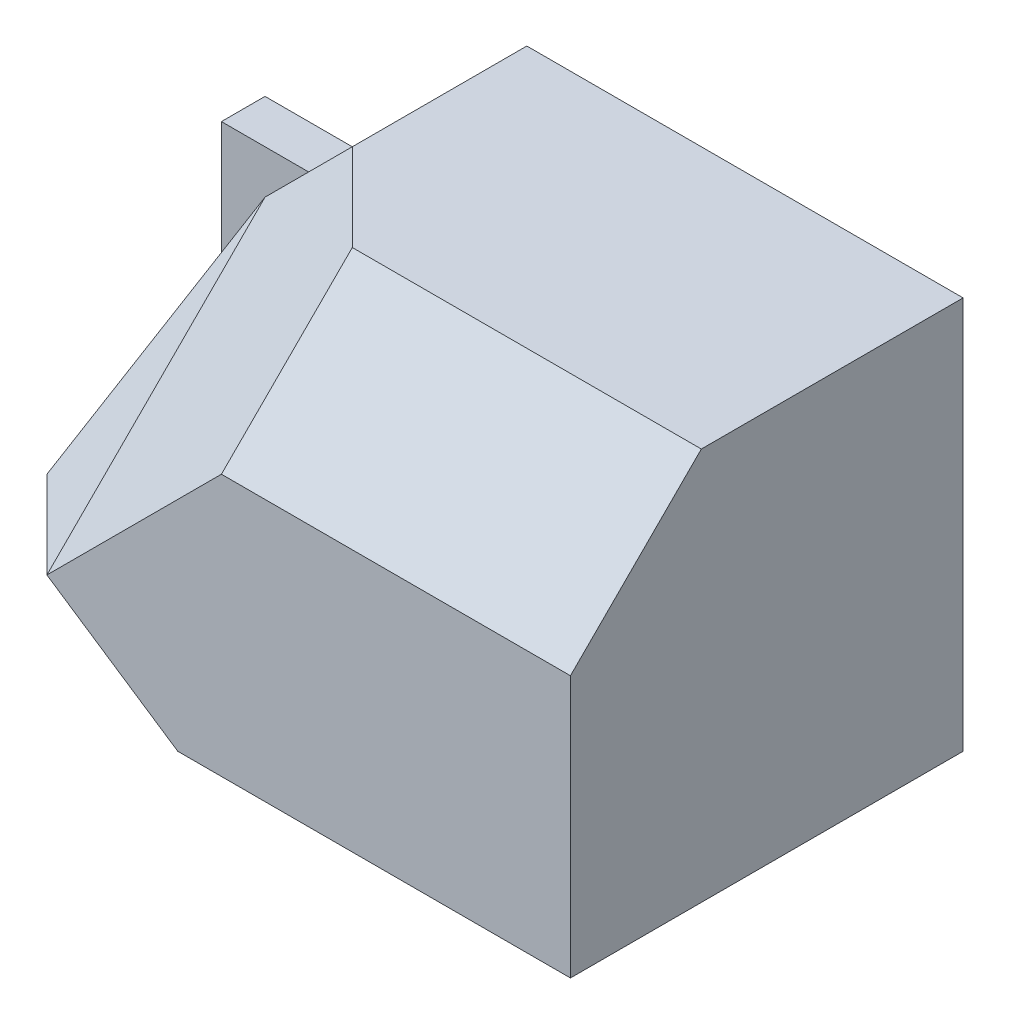
ISO-10303-21;
HEADER;
FILE_DESCRIPTION(('STEP AP214'),'2;1');
FILE_NAME('part.step','',(''),(''),'','','');
FILE_SCHEMA(('AUTOMOTIVE_DESIGN { 1 0 10303 214 1 1 1 1 }'));
ENDSEC;
DATA;
#1=APPLICATION_CONTEXT('core data for automotive mechanical design processes');
#2=APPLICATION_PROTOCOL_DEFINITION('international standard','automotive_design',2000,#1);
#3=PRODUCT_CONTEXT('',#1,'mechanical');
#4=PRODUCT('Part','Part','',(#3));
#5=PRODUCT_RELATED_PRODUCT_CATEGORY('part','',(#4));
#6=PRODUCT_DEFINITION_FORMATION('','',#4);
#7=PRODUCT_DEFINITION_CONTEXT('part definition',#1,'design');
#8=PRODUCT_DEFINITION('design','',#6,#7);
#9=PRODUCT_DEFINITION_SHAPE('','',#8);
#10=(LENGTH_UNIT() NAMED_UNIT(*) SI_UNIT(.MILLI.,.METRE.));
#11=(NAMED_UNIT(*) PLANE_ANGLE_UNIT() SI_UNIT($,.RADIAN.));
#12=(NAMED_UNIT(*) SI_UNIT($,.STERADIAN.) SOLID_ANGLE_UNIT());
#13=UNCERTAINTY_MEASURE_WITH_UNIT(LENGTH_MEASURE(1.E-05),#10,'distance_accuracy_value','');
#14=(GEOMETRIC_REPRESENTATION_CONTEXT(3) GLOBAL_UNCERTAINTY_ASSIGNED_CONTEXT((#13)) GLOBAL_UNIT_ASSIGNED_CONTEXT((#10,
#11,#12)) REPRESENTATION_CONTEXT('',''));
#15=CARTESIAN_POINT('',(0.,0.,0.));
#16=DIRECTION('',(0.,0.,1.));
#17=DIRECTION('',(1.,0.,0.));
#18=AXIS2_PLACEMENT_3D('',#15,#16,#17);
#19=CARTESIAN_POINT('',(-3.25,3.25,9.));
#20=DIRECTION('',(-0.707106781186547,0.707106781186547,0.));
#21=DIRECTION('',(-0.707106781186548,-0.707106781186548,0.));
#22=AXIS2_PLACEMENT_3D('',#19,#20,#21);
#23=PLANE('',#22);
#24=DIRECTION('',(0.,0.,1.));
#25=VECTOR('',#24,1.);
#26=CARTESIAN_POINT('',(-4.,2.5,2.));
#27=LINE('',#26,#25);
#28=CARTESIAN_POINT('',(-4.,2.5,2.));
#29=VERTEX_POINT('',#28);
#30=CARTESIAN_POINT('',(-4.,2.5,4.));
#31=VERTEX_POINT('',#30);
#32=EDGE_CURVE('E168',#29,#31,#27,.T.);
#33=ORIENTED_EDGE('',*,*,#32,.T.);
#34=DIRECTION('',(0.707106781186548,0.707106781186547,0.));
#35=VECTOR('',#34,1.);
#36=CARTESIAN_POINT('',(-4.,2.5,4.));
#37=LINE('',#36,#35);
#38=CARTESIAN_POINT('',(-2.,4.5,4.));
#39=VERTEX_POINT('',#38);
#40=EDGE_CURVE('E51',#31,#39,#37,.T.);
#41=ORIENTED_EDGE('',*,*,#40,.T.);
#42=DIRECTION('',(0.,0.,-1.));
#43=VECTOR('',#42,1.);
#44=CARTESIAN_POINT('',(-2.,4.5,9.));
#45=LINE('',#44,#43);
#46=CARTESIAN_POINT('',(-2.,4.5,0.));
#47=VERTEX_POINT('',#46);
#48=EDGE_CURVE('E187',#39,#47,#45,.T.);
#49=ORIENTED_EDGE('',*,*,#48,.T.);
#50=DIRECTION('',(0.707106781186548,0.707106781186548,0.));
#51=VECTOR('',#50,1.);
#52=CARTESIAN_POINT('',(-3.25,3.25,0.));
#53=LINE('',#52,#51);
#54=CARTESIAN_POINT('',(-6.,0.5,0.));
#55=VERTEX_POINT('',#54);
#56=EDGE_CURVE('E180',#55,#47,#53,.T.);
#57=ORIENTED_EDGE('',*,*,#56,.F.);
#58=DIRECTION('',(0.,0.,-1.));
#59=VECTOR('',#58,1.);
#60=CARTESIAN_POINT('',(-6.,0.5,9.));
#61=LINE('',#60,#59);
#62=CARTESIAN_POINT('',(-6.,0.5,0.999999999999999));
#63=VERTEX_POINT('',#62);
#64=EDGE_CURVE('E43',#63,#55,#61,.T.);
#65=ORIENTED_EDGE('',*,*,#64,.F.);
#66=CARTESIAN_POINT('',(-6.,0.5,2.));
#67=VERTEX_POINT('',#66);
#68=EDGE_CURVE('E12',#67,#63,#61,.T.);
#69=ORIENTED_EDGE('',*,*,#68,.F.);
#70=DIRECTION('',(-0.707106781186547,-0.707106781186548,0.));
#71=VECTOR('',#70,1.);
#72=CARTESIAN_POINT('',(-6.,0.5,2.));
#73=LINE('',#72,#71);
#74=EDGE_CURVE('E59',#29,#67,#73,.T.);
#75=ORIENTED_EDGE('',*,*,#74,.F.);
#76=EDGE_LOOP('',(#33,#41,#49,#57,#65,#69,#75));
#77=FACE_BOUND('',#76,.T.);
#78=ADVANCED_FACE('F35',(#77),#23,.T.);
#79=CARTESIAN_POINT('',(0.,4.5,9.));
#80=DIRECTION('',(0.,1.,0.));
#81=DIRECTION('',(0.,0.,1.));
#82=AXIS2_PLACEMENT_3D('',#79,#80,#81);
#83=PLANE('',#82);
#84=DIRECTION('',(-1.,0.,0.));
#85=VECTOR('',#84,1.);
#86=CARTESIAN_POINT('',(8.,4.5,6.));
#87=LINE('',#86,#85);
#88=CARTESIAN_POINT('',(8.,4.5,6.));
#89=VERTEX_POINT('',#88);
#90=CARTESIAN_POINT('',(0.,4.5,6.));
#91=VERTEX_POINT('',#90);
#92=EDGE_CURVE('E212',#89,#91,#87,.T.);
#93=ORIENTED_EDGE('',*,*,#92,.F.);
#94=DIRECTION('',(0.,0.,-1.));
#95=VECTOR('',#94,1.);
#96=CARTESIAN_POINT('',(8.,4.5,9.));
#97=LINE('',#96,#95);
#98=CARTESIAN_POINT('',(8.,4.5,0.));
#99=VERTEX_POINT('',#98);
#100=EDGE_CURVE('E205',#89,#99,#97,.T.);
#101=ORIENTED_EDGE('',*,*,#100,.T.);
#102=DIRECTION('',(1.,0.,0.));
#103=VECTOR('',#102,1.);
#104=CARTESIAN_POINT('',(0.,4.5,0.));
#105=LINE('',#104,#103);
#106=EDGE_CURVE('E184',#47,#99,#105,.T.);
#107=ORIENTED_EDGE('',*,*,#106,.F.);
#108=ORIENTED_EDGE('',*,*,#48,.F.);
#109=DIRECTION('',(0.707106781186547,0.,0.707106781186548));
#110=VECTOR('',#109,1.);
#111=CARTESIAN_POINT('',(-2.,4.5,4.));
#112=LINE('',#111,#110);
#113=EDGE_CURVE('E285',#39,#91,#112,.T.);
#114=ORIENTED_EDGE('',*,*,#113,.T.);
#115=EDGE_LOOP('',(#93,#101,#107,#108,#114));
#116=FACE_BOUND('',#115,.T.);
#117=ADVANCED_FACE('F277',(#116),#83,.T.);
#118=CARTESIAN_POINT('',(0.,0.,9.));
#119=DIRECTION('',(0.,0.,1.));
#120=DIRECTION('',(1.,0.,0.));
#121=AXIS2_PLACEMENT_3D('',#118,#119,#120);
#122=PLANE('',#121);
#123=DIRECTION('',(-0.832050294337844,0.554700196225229,0.));
#124=VECTOR('',#123,1.);
#125=CARTESIAN_POINT('',(-4.,-2.5,9.));
#126=LINE('',#125,#124);
#127=CARTESIAN_POINT('',(-1.,-4.5,9.));
#128=VERTEX_POINT('',#127);
#129=CARTESIAN_POINT('',(-4.,-2.5,9.));
#130=VERTEX_POINT('',#129);
#131=EDGE_CURVE('E143',#128,#130,#126,.T.);
#132=ORIENTED_EDGE('',*,*,#131,.F.);
#133=DIRECTION('',(1.,0.,0.));
#134=VECTOR('',#133,1.);
#135=CARTESIAN_POINT('',(0.,-4.5,9.));
#136=LINE('',#135,#134);
#137=CARTESIAN_POINT('',(8.,-4.5,9.));
#138=VERTEX_POINT('',#137);
#139=EDGE_CURVE('E181',#128,#138,#136,.T.);
#140=ORIENTED_EDGE('',*,*,#139,.T.);
#141=DIRECTION('',(0.,1.,0.));
#142=VECTOR('',#141,1.);
#143=CARTESIAN_POINT('',(8.,0.,9.));
#144=LINE('',#143,#142);
#145=CARTESIAN_POINT('',(8.,1.5,9.));
#146=VERTEX_POINT('',#145);
#147=EDGE_CURVE('E183',#138,#146,#144,.T.);
#148=ORIENTED_EDGE('',*,*,#147,.T.);
#149=DIRECTION('',(-1.,0.,0.));
#150=VECTOR('',#149,1.);
#151=CARTESIAN_POINT('',(8.,1.5,9.));
#152=LINE('',#151,#150);
#153=CARTESIAN_POINT('',(0.,1.5,9.));
#154=VERTEX_POINT('',#153);
#155=EDGE_CURVE('E214',#146,#154,#152,.T.);
#156=ORIENTED_EDGE('',*,*,#155,.T.);
#157=DIRECTION('',(-0.707106781186548,-0.707106781186548,0.));
#158=VECTOR('',#157,1.);
#159=CARTESIAN_POINT('',(-4.,-2.5,9.));
#160=LINE('',#159,#158);
#161=EDGE_CURVE('E236',#154,#130,#160,.T.);
#162=ORIENTED_EDGE('',*,*,#161,.T.);
#163=EDGE_LOOP('',(#132,#140,#148,#156,#162));
#164=FACE_BOUND('',#163,.T.);
#165=ADVANCED_FACE('F239',(#164),#122,.T.);
#166=CARTESIAN_POINT('',(-4.,2.5,2.));
#167=DIRECTION('',(1.,0.,0.));
#168=DIRECTION('',(0.,1.,0.));
#169=AXIS2_PLACEMENT_3D('',#166,#167,#168);
#170=PLANE('',#169);
#171=DIRECTION('',(0.,0.707106781186548,-0.707106781186548));
#172=VECTOR('',#171,1.);
#173=CARTESIAN_POINT('',(-4.,-2.5,9.));
#174=LINE('',#173,#172);
#175=EDGE_CURVE('E220',#130,#31,#174,.T.);
#176=ORIENTED_EDGE('',*,*,#175,.T.);
#177=ORIENTED_EDGE('',*,*,#32,.F.);
#178=DIRECTION('',(0.,0.707106781186547,-0.707106781186548));
#179=VECTOR('',#178,1.);
#180=CARTESIAN_POINT('',(-4.,2.5,2.));
#181=LINE('',#180,#179);
#182=CARTESIAN_POINT('',(-4.,-2.5,7.));
#183=VERTEX_POINT('',#182);
#184=EDGE_CURVE('E134',#183,#29,#181,.T.);
#185=ORIENTED_EDGE('',*,*,#184,.F.);
#186=DIRECTION('',(0.,0.,1.));
#187=VECTOR('',#186,1.);
#188=CARTESIAN_POINT('',(-4.,-2.5,7.));
#189=LINE('',#188,#187);
#190=EDGE_CURVE('E160',#183,#130,#189,.T.);
#191=ORIENTED_EDGE('',*,*,#190,.T.);
#192=EDGE_LOOP('',(#176,#177,#185,#191));
#193=FACE_BOUND('',#192,.T.);
#194=ADVANCED_FACE('F242',(#193),#170,.F.);
#195=CARTESIAN_POINT('',(0.,-4.5,9.));
#196=DIRECTION('',(0.,1.,0.));
#197=DIRECTION('',(0.,0.,1.));
#198=AXIS2_PLACEMENT_3D('',#195,#196,#197);
#199=PLANE('',#198);
#200=ORIENTED_EDGE('',*,*,#139,.F.);
#201=DIRECTION('',(0.,0.,1.));
#202=VECTOR('',#201,1.);
#203=CARTESIAN_POINT('',(-1.,-4.5,7.));
#204=LINE('',#203,#202);
#205=CARTESIAN_POINT('',(-1.,-4.5,7.));
#206=VERTEX_POINT('',#205);
#207=EDGE_CURVE('E142',#206,#128,#204,.T.);
#208=ORIENTED_EDGE('',*,*,#207,.F.);
#209=DIRECTION('',(1.,0.,0.));
#210=VECTOR('',#209,1.);
#211=CARTESIAN_POINT('',(-1.,-4.5,7.));
#212=LINE('',#211,#210);
#213=CARTESIAN_POINT('',(-6.,-4.5,7.));
#214=VERTEX_POINT('',#213);
#215=EDGE_CURVE('E128',#214,#206,#212,.T.);
#216=ORIENTED_EDGE('',*,*,#215,.F.);
#217=DIRECTION('',(0.707106781186548,0.,0.707106781186548));
#218=VECTOR('',#217,1.);
#219=CARTESIAN_POINT('',(-8.,-4.5,5.));
#220=LINE('',#219,#218);
#221=CARTESIAN_POINT('',(-8.,-4.5,5.));
#222=VERTEX_POINT('',#221);
#223=EDGE_CURVE('E133',#222,#214,#220,.T.);
#224=ORIENTED_EDGE('',*,*,#223,.F.);
#225=DIRECTION('',(0.,0.,-1.));
#226=VECTOR('',#225,1.);
#227=CARTESIAN_POINT('',(-8.,-4.5,9.));
#228=LINE('',#227,#226);
#229=CARTESIAN_POINT('',(-8.,-4.5,0.999999999999999));
#230=VERTEX_POINT('',#229);
#231=EDGE_CURVE('E210',#222,#230,#228,.T.);
#232=ORIENTED_EDGE('',*,*,#231,.T.);
#233=CARTESIAN_POINT('',(-8.,-4.5,0.));
#234=VERTEX_POINT('',#233);
#235=EDGE_CURVE('E264',#230,#234,#228,.T.);
#236=ORIENTED_EDGE('',*,*,#235,.T.);
#237=DIRECTION('',(1.,0.,0.));
#238=VECTOR('',#237,1.);
#239=CARTESIAN_POINT('',(0.,-4.5,0.));
#240=LINE('',#239,#238);
#241=CARTESIAN_POINT('',(8.,-4.5,0.));
#242=VERTEX_POINT('',#241);
#243=EDGE_CURVE('E196',#234,#242,#240,.T.);
#244=ORIENTED_EDGE('',*,*,#243,.T.);
#245=DIRECTION('',(0.,0.,-1.));
#246=VECTOR('',#245,1.);
#247=CARTESIAN_POINT('',(8.,-4.5,9.));
#248=LINE('',#247,#246);
#249=EDGE_CURVE('E267',#138,#242,#248,.T.);
#250=ORIENTED_EDGE('',*,*,#249,.F.);
#251=EDGE_LOOP('',(#200,#208,#216,#224,#232,#236,#244,#250));
#252=FACE_BOUND('',#251,.T.);
#253=ADVANCED_FACE('F140',(#252),#199,.F.);
#254=CARTESIAN_POINT('',(-6.,0.5,0.999999999999999));
#255=DIRECTION('',(0.928476690885259,-0.371390676354104,0.));
#256=DIRECTION('',(0.371390676354104,0.928476690885259,0.));
#257=AXIS2_PLACEMENT_3D('',#254,#255,#256);
#258=PLANE('',#257);
#259=DIRECTION('',(-0.324442842261525,-0.811107105653813,0.486664263392288));
#260=VECTOR('',#259,1.);
#261=CARTESIAN_POINT('',(-8.,-4.5,5.));
#262=LINE('',#261,#260);
#263=EDGE_CURVE('E146',#67,#222,#262,.T.);
#264=ORIENTED_EDGE('',*,*,#263,.F.);
#265=ORIENTED_EDGE('',*,*,#68,.T.);
#266=DIRECTION('',(0.371390676354104,0.928476690885259,0.));
#267=VECTOR('',#266,1.);
#268=CARTESIAN_POINT('',(-6.,0.5,0.999999999999999));
#269=LINE('',#268,#267);
#270=EDGE_CURVE('E150',#230,#63,#269,.T.);
#271=ORIENTED_EDGE('',*,*,#270,.F.);
#272=ORIENTED_EDGE('',*,*,#231,.F.);
#273=EDGE_LOOP('',(#264,#265,#271,#272));
#274=FACE_BOUND('',#273,.T.);
#275=ADVANCED_FACE('F249',(#274),#258,.F.);
#276=CARTESIAN_POINT('',(0.,0.5,9.));
#277=DIRECTION('',(0.,1.,0.));
#278=DIRECTION('',(0.,0.,1.));
#279=AXIS2_PLACEMENT_3D('',#276,#277,#278);
#280=PLANE('',#279);
#281=DIRECTION('',(-1.,0.,0.));
#282=VECTOR('',#281,1.);
#283=CARTESIAN_POINT('',(-8.,0.5,0.999999999999999));
#284=LINE('',#283,#282);
#285=CARTESIAN_POINT('',(-8.,0.5,0.999999999999999));
#286=VERTEX_POINT('',#285);
#287=EDGE_CURVE('E178',#63,#286,#284,.T.);
#288=ORIENTED_EDGE('',*,*,#287,.F.);
#289=ORIENTED_EDGE('',*,*,#64,.T.);
#290=DIRECTION('',(1.,0.,0.));
#291=VECTOR('',#290,1.);
#292=CARTESIAN_POINT('',(0.,0.5,0.));
#293=LINE('',#292,#291);
#294=CARTESIAN_POINT('',(-8.,0.5,0.));
#295=VERTEX_POINT('',#294);
#296=EDGE_CURVE('E190',#295,#55,#293,.T.);
#297=ORIENTED_EDGE('',*,*,#296,.F.);
#298=DIRECTION('',(0.,0.,-1.));
#299=VECTOR('',#298,1.);
#300=CARTESIAN_POINT('',(-8.,0.5,9.));
#301=LINE('',#300,#299);
#302=EDGE_CURVE('E259',#286,#295,#301,.T.);
#303=ORIENTED_EDGE('',*,*,#302,.F.);
#304=EDGE_LOOP('',(#288,#289,#297,#303));
#305=FACE_BOUND('',#304,.T.);
#306=ADVANCED_FACE('F257',(#305),#280,.T.);
#307=CARTESIAN_POINT('',(-8.,0.,9.));
#308=DIRECTION('',(-1.,0.,0.));
#309=DIRECTION('',(0.,0.,1.));
#310=AXIS2_PLACEMENT_3D('',#307,#308,#309);
#311=PLANE('',#310);
#312=DIRECTION('',(0.,-1.,0.));
#313=VECTOR('',#312,1.);
#314=CARTESIAN_POINT('',(-8.,-4.5,0.999999999999999));
#315=LINE('',#314,#313);
#316=EDGE_CURVE('E147',#286,#230,#315,.T.);
#317=ORIENTED_EDGE('',*,*,#316,.F.);
#318=ORIENTED_EDGE('',*,*,#302,.T.);
#319=DIRECTION('',(0.,1.,0.));
#320=VECTOR('',#319,1.);
#321=CARTESIAN_POINT('',(-8.,0.,0.));
#322=LINE('',#321,#320);
#323=EDGE_CURVE('E193',#234,#295,#322,.T.);
#324=ORIENTED_EDGE('',*,*,#323,.F.);
#325=ORIENTED_EDGE('',*,*,#235,.F.);
#326=EDGE_LOOP('',(#317,#318,#324,#325));
#327=FACE_BOUND('',#326,.T.);
#328=ADVANCED_FACE('F302',(#327),#311,.T.);
#329=CARTESIAN_POINT('',(8.,0.,9.));
#330=DIRECTION('',(-1.,0.,0.));
#331=DIRECTION('',(0.,0.,1.));
#332=AXIS2_PLACEMENT_3D('',#329,#330,#331);
#333=PLANE('',#332);
#334=ORIENTED_EDGE('',*,*,#100,.F.);
#335=DIRECTION('',(0.,-0.707106781186548,0.707106781186547));
#336=VECTOR('',#335,1.);
#337=CARTESIAN_POINT('',(8.,1.5,9.));
#338=LINE('',#337,#336);
#339=EDGE_CURVE('E215',#89,#146,#338,.T.);
#340=ORIENTED_EDGE('',*,*,#339,.T.);
#341=ORIENTED_EDGE('',*,*,#147,.F.);
#342=ORIENTED_EDGE('',*,*,#249,.T.);
#343=DIRECTION('',(0.,1.,0.));
#344=VECTOR('',#343,1.);
#345=CARTESIAN_POINT('',(8.,0.,0.));
#346=LINE('',#345,#344);
#347=EDGE_CURVE('E198',#242,#99,#346,.T.);
#348=ORIENTED_EDGE('',*,*,#347,.T.);
#349=EDGE_LOOP('',(#334,#340,#341,#342,#348));
#350=FACE_BOUND('',#349,.T.);
#351=ADVANCED_FACE('F281',(#350),#333,.F.);
#352=CARTESIAN_POINT('',(0.,0.,0.));
#353=DIRECTION('',(0.,0.,1.));
#354=DIRECTION('',(1.,0.,0.));
#355=AXIS2_PLACEMENT_3D('',#352,#353,#354);
#356=PLANE('',#355);
#357=ORIENTED_EDGE('',*,*,#56,.T.);
#358=ORIENTED_EDGE('',*,*,#106,.T.);
#359=ORIENTED_EDGE('',*,*,#347,.F.);
#360=ORIENTED_EDGE('',*,*,#243,.F.);
#361=ORIENTED_EDGE('',*,*,#323,.T.);
#362=ORIENTED_EDGE('',*,*,#296,.T.);
#363=EDGE_LOOP('',(#357,#358,#359,#360,#361,#362));
#364=FACE_BOUND('',#363,.T.);
#365=ADVANCED_FACE('F284',(#364),#356,.F.);
#366=CARTESIAN_POINT('',(0.,0.,0.999999999999999));
#367=DIRECTION('',(0.,0.,-1.));
#368=DIRECTION('',(-1.,0.,0.));
#369=AXIS2_PLACEMENT_3D('',#366,#367,#368);
#370=PLANE('',#369);
#371=ORIENTED_EDGE('',*,*,#316,.T.);
#372=ORIENTED_EDGE('',*,*,#270,.T.);
#373=ORIENTED_EDGE('',*,*,#287,.T.);
#374=EDGE_LOOP('',(#371,#372,#373));
#375=FACE_BOUND('',#374,.T.);
#376=ADVANCED_FACE('F252',(#375),#370,.F.);
#377=CARTESIAN_POINT('',(-2.83333333333333,2.83333333333333,2.83333333333334));
#378=DIRECTION('',(-0.577350269189625,0.577350269189626,0.577350269189626));
#379=DIRECTION('',(0.,-0.707106781186548,0.707106781186547));
#380=AXIS2_PLACEMENT_3D('',#377,#378,#379);
#381=PLANE('',#380);
#382=ORIENTED_EDGE('',*,*,#263,.T.);
#383=ORIENTED_EDGE('',*,*,#223,.T.);
#384=DIRECTION('',(0.707106781186548,0.707106781186548,0.));
#385=VECTOR('',#384,1.);
#386=CARTESIAN_POINT('',(-4.,-2.5,7.));
#387=LINE('',#386,#385);
#388=EDGE_CURVE('E125',#214,#183,#387,.T.);
#389=ORIENTED_EDGE('',*,*,#388,.T.);
#390=ORIENTED_EDGE('',*,*,#184,.T.);
#391=ORIENTED_EDGE('',*,*,#74,.T.);
#392=EDGE_LOOP('',(#382,#383,#389,#390,#391));
#393=FACE_BOUND('',#392,.T.);
#394=ADVANCED_FACE('F145',(#393),#381,.T.);
#395=CARTESIAN_POINT('',(-3.5,3.5,3.5));
#396=DIRECTION('',(-0.577350269189625,0.577350269189626,0.577350269189626));
#397=DIRECTION('',(0.,-0.707106781186547,0.707106781186547));
#398=AXIS2_PLACEMENT_3D('',#395,#396,#397);
#399=PLANE('',#398);
#400=ORIENTED_EDGE('',*,*,#40,.F.);
#401=ORIENTED_EDGE('',*,*,#175,.F.);
#402=ORIENTED_EDGE('',*,*,#161,.F.);
#403=DIRECTION('',(0.,-0.707106781186548,0.707106781186547));
#404=VECTOR('',#403,1.);
#405=CARTESIAN_POINT('',(0.,1.5,9.));
#406=LINE('',#405,#404);
#407=EDGE_CURVE('E240',#91,#154,#406,.T.);
#408=ORIENTED_EDGE('',*,*,#407,.F.);
#409=ORIENTED_EDGE('',*,*,#113,.F.);
#410=EDGE_LOOP('',(#400,#401,#402,#408,#409));
#411=FACE_BOUND('',#410,.T.);
#412=ADVANCED_FACE('F234',(#411),#399,.T.);
#413=CARTESIAN_POINT('',(8.,1.5,9.));
#414=DIRECTION('',(0.,-0.707106781186547,-0.707106781186548));
#415=DIRECTION('',(0.,0.707106781186548,-0.707106781186547));
#416=AXIS2_PLACEMENT_3D('',#413,#414,#415);
#417=PLANE('',#416);
#418=ORIENTED_EDGE('',*,*,#407,.T.);
#419=ORIENTED_EDGE('',*,*,#155,.F.);
#420=ORIENTED_EDGE('',*,*,#339,.F.);
#421=ORIENTED_EDGE('',*,*,#92,.T.);
#422=EDGE_LOOP('',(#418,#419,#420,#421));
#423=FACE_BOUND('',#422,.T.);
#424=ADVANCED_FACE('F356',(#423),#417,.F.);
#425=CARTESIAN_POINT('',(-4.,-2.5,7.));
#426=DIRECTION('',(0.554700196225229,0.832050294337844,0.));
#427=DIRECTION('',(-0.832050294337844,0.554700196225229,0.));
#428=AXIS2_PLACEMENT_3D('',#425,#426,#427);
#429=PLANE('',#428);
#430=ORIENTED_EDGE('',*,*,#131,.T.);
#431=ORIENTED_EDGE('',*,*,#190,.F.);
#432=DIRECTION('',(-0.832050294337844,0.554700196225229,0.));
#433=VECTOR('',#432,1.);
#434=CARTESIAN_POINT('',(-4.,-2.5,7.));
#435=LINE('',#434,#433);
#436=EDGE_CURVE('E130',#206,#183,#435,.T.);
#437=ORIENTED_EDGE('',*,*,#436,.F.);
#438=ORIENTED_EDGE('',*,*,#207,.T.);
#439=EDGE_LOOP('',(#430,#431,#437,#438));
#440=FACE_BOUND('',#439,.T.);
#441=ADVANCED_FACE('F229',(#440),#429,.F.);
#442=CARTESIAN_POINT('',(0.,0.,7.));
#443=DIRECTION('',(0.,0.,-1.));
#444=DIRECTION('',(-1.,0.,0.));
#445=AXIS2_PLACEMENT_3D('',#442,#443,#444);
#446=PLANE('',#445);
#447=ORIENTED_EDGE('',*,*,#388,.F.);
#448=ORIENTED_EDGE('',*,*,#215,.T.);
#449=ORIENTED_EDGE('',*,*,#436,.T.);
#450=EDGE_LOOP('',(#447,#448,#449));
#451=FACE_BOUND('',#450,.T.);
#452=ADVANCED_FACE('F127',(#451),#446,.F.);
#453=CLOSED_SHELL('',(#78,#117,#165,#194,#253,#275,#306,#328,#351,#365,#376,#394,#412,#424,#441,#452));
#454=MANIFOLD_SOLID_BREP('B2',#453);
#455=ADVANCED_BREP_SHAPE_REPRESENTATION('',(#18,#454),#14);
#456=SHAPE_DEFINITION_REPRESENTATION(#9,#455);
ENDSEC;
END-ISO-10303-21;
